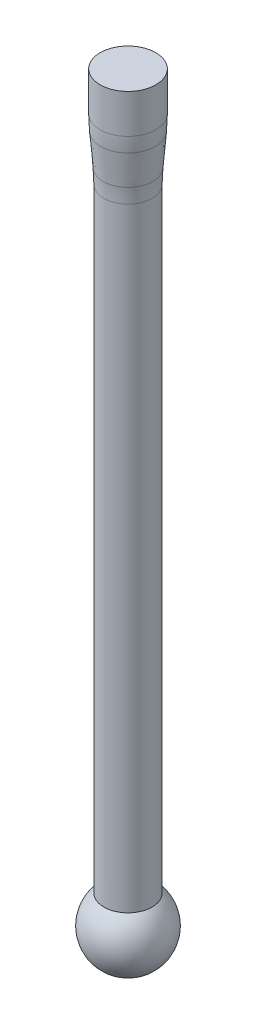
ISO-10303-21;
HEADER;
FILE_DESCRIPTION(('STEP AP214'),'2;1');
FILE_NAME('part.step','',(''),(''),'','','');
FILE_SCHEMA(('AUTOMOTIVE_DESIGN { 1 0 10303 214 1 1 1 1 }'));
ENDSEC;
DATA;
#1=APPLICATION_CONTEXT('core data for automotive mechanical design processes');
#2=APPLICATION_PROTOCOL_DEFINITION('international standard','automotive_design',2000,#1);
#3=PRODUCT_CONTEXT('',#1,'mechanical');
#4=PRODUCT('Part','Part','',(#3));
#5=PRODUCT_RELATED_PRODUCT_CATEGORY('part','',(#4));
#6=PRODUCT_DEFINITION_FORMATION('','',#4);
#7=PRODUCT_DEFINITION_CONTEXT('part definition',#1,'design');
#8=PRODUCT_DEFINITION('design','',#6,#7);
#9=PRODUCT_DEFINITION_SHAPE('','',#8);
#10=(LENGTH_UNIT() NAMED_UNIT(*) SI_UNIT(.MILLI.,.METRE.));
#11=(NAMED_UNIT(*) PLANE_ANGLE_UNIT() SI_UNIT($,.RADIAN.));
#12=(NAMED_UNIT(*) SI_UNIT($,.STERADIAN.) SOLID_ANGLE_UNIT());
#13=UNCERTAINTY_MEASURE_WITH_UNIT(LENGTH_MEASURE(1.E-05),#10,'distance_accuracy_value','');
#14=(GEOMETRIC_REPRESENTATION_CONTEXT(3) GLOBAL_UNCERTAINTY_ASSIGNED_CONTEXT((#13)) GLOBAL_UNIT_ASSIGNED_CONTEXT((#10,
#11,#12)) REPRESENTATION_CONTEXT('',''));
#15=CARTESIAN_POINT('',(0.,0.,0.));
#16=DIRECTION('',(0.,0.,1.));
#17=DIRECTION('',(1.,0.,0.));
#18=AXIS2_PLACEMENT_3D('',#15,#16,#17);
#19=CARTESIAN_POINT('',(0.,-40.,0.));
#20=DIRECTION('',(0.,-1.,0.));
#21=DIRECTION('',(-1.,0.,0.));
#22=AXIS2_PLACEMENT_3D('',#19,#20,#21);
#23=SPHERICAL_SURFACE('',#22,2.);
#24=CARTESIAN_POINT('',(1.31996432845214E-13,-38.4801315846429,0.));
#25=DIRECTION('',(0.,-1.,0.));
#26=DIRECTION('',(1.,0.,0.));
#27=AXIS2_PLACEMENT_3D('',#24,#25,#26);
#28=CIRCLE('',#27,1.29999999999987);
#29=CARTESIAN_POINT('',(1.3,-38.4801315846429,0.));
#30=VERTEX_POINT('',#29);
#31=EDGE_CURVE('E63',#30,#30,#28,.T.);
#32=ORIENTED_EDGE('',*,*,#31,.T.);
#33=EDGE_LOOP('',(#32));
#34=FACE_BOUND('',#33,.T.);
#35=ADVANCED_FACE('F43',(#34),#23,.T.);
#36=CARTESIAN_POINT('',(4.10841135839163E-13,-119.770062165346,0.));
#37=DIRECTION('',(0.,-1.,0.));
#38=DIRECTION('',(1.,0.,0.));
#39=AXIS2_PLACEMENT_3D('',#36,#37,#38);
#40=CYLINDRICAL_SURFACE('',#39,1.29999999999993);
#41=CARTESIAN_POINT('',(0.,-5.39936203984526,0.));
#42=DIRECTION('',(0.,-1.,0.));
#43=DIRECTION('',(1.,0.,0.));
#44=AXIS2_PLACEMENT_3D('',#41,#42,#43);
#45=CIRCLE('',#44,1.29999999999993);
#46=CARTESIAN_POINT('',(1.29999999999995,-5.39936203984525,0.));
#47=VERTEX_POINT('',#46);
#48=EDGE_CURVE('E58',#47,#47,#45,.T.);
#49=ORIENTED_EDGE('',*,*,#48,.T.);
#50=EDGE_LOOP('',(#49));
#51=FACE_BOUND('',#50,.T.);
#52=ORIENTED_EDGE('',*,*,#31,.F.);
#53=EDGE_LOOP('',(#52));
#54=FACE_BOUND('',#53,.T.);
#55=ADVANCED_FACE('F86',(#51,#54),#40,.T.);
#56=CARTESIAN_POINT('',(0.,-5.,0.));
#57=DIRECTION('',(0.,1.,0.));
#58=DIRECTION('',(-1.,0.,0.));
#59=AXIS2_PLACEMENT_3D('',#56,#57,#58);
#60=CONICAL_SURFACE('',#59,1.29999999999998,0.0798299857122404);
#61=CARTESIAN_POINT('',(0.,-4.60190981701633,0.));
#62=DIRECTION('',(0.,1.,0.));
#63=DIRECTION('',(-1.,0.,0.));
#64=AXIS2_PLACEMENT_3D('',#61,#62,#63);
#65=CIRCLE('',#64,1.33184721463868);
#66=CARTESIAN_POINT('',(-1.33184721463866,-4.60190981701633,0.));
#67=VERTEX_POINT('',#66);
#68=EDGE_CURVE('E50',#67,#67,#65,.T.);
#69=ORIENTED_EDGE('',*,*,#68,.T.);
#70=EDGE_LOOP('',(#69));
#71=FACE_BOUND('',#70,.T.);
#72=CARTESIAN_POINT('',(0.,-2.89809018298433,0.));
#73=DIRECTION('',(0.,-1.,0.));
#74=DIRECTION('',(1.,0.,0.));
#75=AXIS2_PLACEMENT_3D('',#72,#73,#74);
#76=CIRCLE('',#75,1.46815278536124);
#77=CARTESIAN_POINT('',(1.46815278536125,-2.89809018298432,0.));
#78=VERTEX_POINT('',#77);
#79=EDGE_CURVE('E54',#78,#78,#76,.T.);
#80=ORIENTED_EDGE('',*,*,#79,.T.);
#81=EDGE_LOOP('',(#80));
#82=FACE_BOUND('',#81,.T.);
#83=ADVANCED_FACE('F83',(#71,#82),#60,.T.);
#84=CARTESIAN_POINT('',(4.10841135839163E-13,-119.770062165346,0.));
#85=DIRECTION('',(0.,-1.,0.));
#86=DIRECTION('',(1.,0.,0.));
#87=AXIS2_PLACEMENT_3D('',#84,#85,#86);
#88=CYLINDRICAL_SURFACE('',#87,1.5);
#89=CARTESIAN_POINT('',(0.,-2.1006379601554,0.));
#90=DIRECTION('',(0.,1.,0.));
#91=DIRECTION('',(-1.,0.,0.));
#92=AXIS2_PLACEMENT_3D('',#89,#90,#91);
#93=CIRCLE('',#92,1.5);
#94=CARTESIAN_POINT('',(-1.49999999999999,-2.10063796015541,0.));
#95=VERTEX_POINT('',#94);
#96=EDGE_CURVE('E10',#95,#95,#93,.T.);
#97=ORIENTED_EDGE('',*,*,#96,.T.);
#98=EDGE_LOOP('',(#97));
#99=FACE_BOUND('',#98,.T.);
#100=CARTESIAN_POINT('',(0.,0.,0.));
#101=DIRECTION('',(0.,-1.,0.));
#102=DIRECTION('',(1.,0.,0.));
#103=AXIS2_PLACEMENT_3D('',#100,#101,#102);
#104=CIRCLE('',#103,1.5);
#105=CARTESIAN_POINT('',(1.5,0.,0.));
#106=VERTEX_POINT('',#105);
#107=EDGE_CURVE('E66',#106,#106,#104,.T.);
#108=ORIENTED_EDGE('',*,*,#107,.T.);
#109=EDGE_LOOP('',(#108));
#110=FACE_BOUND('',#109,.T.);
#111=ADVANCED_FACE('F70',(#99,#110),#88,.T.);
#112=CARTESIAN_POINT('',(0.,0.,0.));
#113=DIRECTION('',(0.,1.,0.));
#114=DIRECTION('',(-1.,0.,0.));
#115=AXIS2_PLACEMENT_3D('',#112,#113,#114);
#116=PLANE('',#115);
#117=ORIENTED_EDGE('',*,*,#107,.F.);
#118=EDGE_LOOP('',(#117));
#119=FACE_BOUND('',#118,.T.);
#120=ADVANCED_FACE('F72',(#119),#116,.T.);
#121=CARTESIAN_POINT('',(0.,-5.39936203984526,0.));
#122=DIRECTION('',(0.,-1.,0.));
#123=DIRECTION('',(1.,0.,0.));
#124=AXIS2_PLACEMENT_3D('',#121,#122,#123);
#125=TOROIDAL_SURFACE('',#124,11.2999999999999,10.);
#126=ORIENTED_EDGE('',*,*,#68,.F.);
#127=EDGE_LOOP('',(#126));
#128=FACE_BOUND('',#127,.T.);
#129=ORIENTED_EDGE('',*,*,#48,.F.);
#130=EDGE_LOOP('',(#129));
#131=FACE_BOUND('',#130,.T.);
#132=ADVANCED_FACE('F74',(#128,#131),#125,.F.);
#133=CARTESIAN_POINT('',(0.,-2.1006379601554,0.));
#134=DIRECTION('',(0.,1.,0.));
#135=DIRECTION('',(-1.,0.,0.));
#136=AXIS2_PLACEMENT_3D('',#133,#134,#135);
#137=DEGENERATE_TOROIDAL_SURFACE('',#136,8.5,10.,.F.);
#138=ORIENTED_EDGE('',*,*,#96,.F.);
#139=EDGE_LOOP('',(#138));
#140=FACE_BOUND('',#139,.T.);
#141=ORIENTED_EDGE('',*,*,#79,.F.);
#142=EDGE_LOOP('',(#141));
#143=FACE_BOUND('',#142,.T.);
#144=ADVANCED_FACE('F45',(#140,#143),#137,.F.);
#145=CLOSED_SHELL('',(#35,#55,#83,#111,#120,#132,#144));
#146=MANIFOLD_SOLID_BREP('B2',#145);
#147=ADVANCED_BREP_SHAPE_REPRESENTATION('',(#18,#146),#14);
#148=SHAPE_DEFINITION_REPRESENTATION(#9,#147);
ENDSEC;
END-ISO-10303-21;
